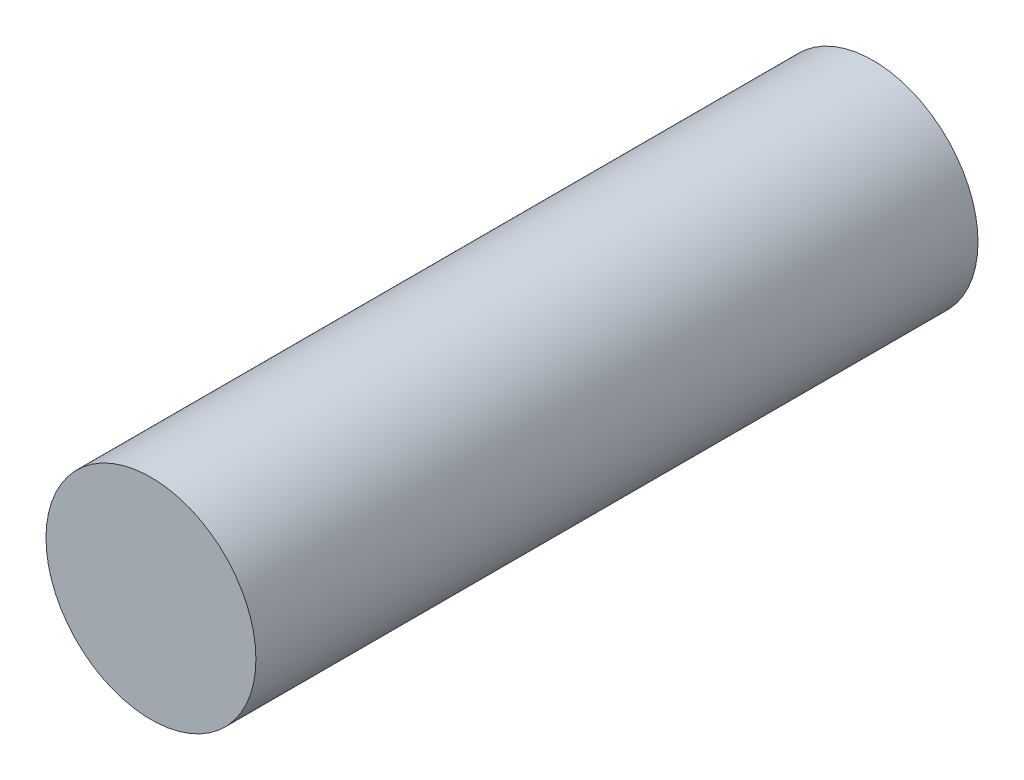
ISO-10303-21;
HEADER;
FILE_DESCRIPTION(('STEP AP214'),'2;1');
FILE_NAME('part.step','',(''),(''),'','','');
FILE_SCHEMA(('AUTOMOTIVE_DESIGN { 1 0 10303 214 1 1 1 1 }'));
ENDSEC;
DATA;
#1=APPLICATION_CONTEXT('core data for automotive mechanical design processes');
#2=APPLICATION_PROTOCOL_DEFINITION('international standard','automotive_design',2000,#1);
#3=PRODUCT_CONTEXT('',#1,'mechanical');
#4=PRODUCT('Part','Part','',(#3));
#5=PRODUCT_RELATED_PRODUCT_CATEGORY('part','',(#4));
#6=PRODUCT_DEFINITION_FORMATION('','',#4);
#7=PRODUCT_DEFINITION_CONTEXT('part definition',#1,'design');
#8=PRODUCT_DEFINITION('design','',#6,#7);
#9=PRODUCT_DEFINITION_SHAPE('','',#8);
#10=(LENGTH_UNIT() NAMED_UNIT(*) SI_UNIT(.MILLI.,.METRE.));
#11=(NAMED_UNIT(*) PLANE_ANGLE_UNIT() SI_UNIT($,.RADIAN.));
#12=(NAMED_UNIT(*) SI_UNIT($,.STERADIAN.) SOLID_ANGLE_UNIT());
#13=UNCERTAINTY_MEASURE_WITH_UNIT(LENGTH_MEASURE(1.E-05),#10,'distance_accuracy_value','');
#14=(GEOMETRIC_REPRESENTATION_CONTEXT(3) GLOBAL_UNCERTAINTY_ASSIGNED_CONTEXT((#13)) GLOBAL_UNIT_ASSIGNED_CONTEXT((#10,
#11,#12)) REPRESENTATION_CONTEXT('',''));
#15=CARTESIAN_POINT('',(0.,0.,0.));
#16=DIRECTION('',(0.,0.,1.));
#17=DIRECTION('',(1.,0.,0.));
#18=AXIS2_PLACEMENT_3D('',#15,#16,#17);
#19=CARTESIAN_POINT('',(0.,0.,-16.256));
#20=DIRECTION('',(0.,0.,-1.));
#21=DIRECTION('',(-1.,0.,0.));
#22=AXIS2_PLACEMENT_3D('',#19,#20,#21);
#23=PLANE('',#22);
#24=CARTESIAN_POINT('',(0.,0.,-16.256));
#25=DIRECTION('',(0.,0.,-1.));
#26=DIRECTION('',(-1.,0.,0.));
#27=AXIS2_PLACEMENT_3D('',#24,#25,#26);
#28=CIRCLE('',#27,4.7625);
#29=CARTESIAN_POINT('',(-4.7625,0.,-16.256));
#30=VERTEX_POINT('',#29);
#31=EDGE_CURVE('E16',#30,#30,#28,.T.);
#32=ORIENTED_EDGE('',*,*,#31,.T.);
#33=EDGE_LOOP('',(#32));
#34=FACE_BOUND('',#33,.T.);
#35=ADVANCED_FACE('F13',(#34),#23,.T.);
#36=CARTESIAN_POINT('',(0.,0.,16.51));
#37=DIRECTION('',(0.,0.,-1.));
#38=DIRECTION('',(-1.,0.,0.));
#39=AXIS2_PLACEMENT_3D('',#36,#37,#38);
#40=PLANE('',#39);
#41=CARTESIAN_POINT('',(0.,0.,16.51));
#42=DIRECTION('',(0.,0.,-1.));
#43=DIRECTION('',(-1.,0.,0.));
#44=AXIS2_PLACEMENT_3D('',#41,#42,#43);
#45=CIRCLE('',#44,4.7625);
#46=CARTESIAN_POINT('',(-4.7625,0.,16.51));
#47=VERTEX_POINT('',#46);
#48=EDGE_CURVE('E9',#47,#47,#45,.T.);
#49=ORIENTED_EDGE('',*,*,#48,.F.);
#50=EDGE_LOOP('',(#49));
#51=FACE_BOUND('',#50,.T.);
#52=ADVANCED_FACE('F28',(#51),#40,.F.);
#53=CARTESIAN_POINT('',(0.,0.,18.796));
#54=DIRECTION('',(0.,0.,-1.));
#55=DIRECTION('',(-1.,0.,0.));
#56=AXIS2_PLACEMENT_3D('',#53,#54,#55);
#57=CYLINDRICAL_SURFACE('',#56,4.7625);
#58=ORIENTED_EDGE('',*,*,#31,.F.);
#59=EDGE_LOOP('',(#58));
#60=FACE_BOUND('',#59,.T.);
#61=ORIENTED_EDGE('',*,*,#48,.T.);
#62=EDGE_LOOP('',(#61));
#63=FACE_BOUND('',#62,.T.);
#64=ADVANCED_FACE('F26',(#60,#63),#57,.T.);
#65=CLOSED_SHELL('',(#35,#52,#64));
#66=MANIFOLD_SOLID_BREP('B1',#65);
#67=ADVANCED_BREP_SHAPE_REPRESENTATION('',(#18,#66),#14);
#68=SHAPE_DEFINITION_REPRESENTATION(#9,#67);
ENDSEC;
END-ISO-10303-21;
